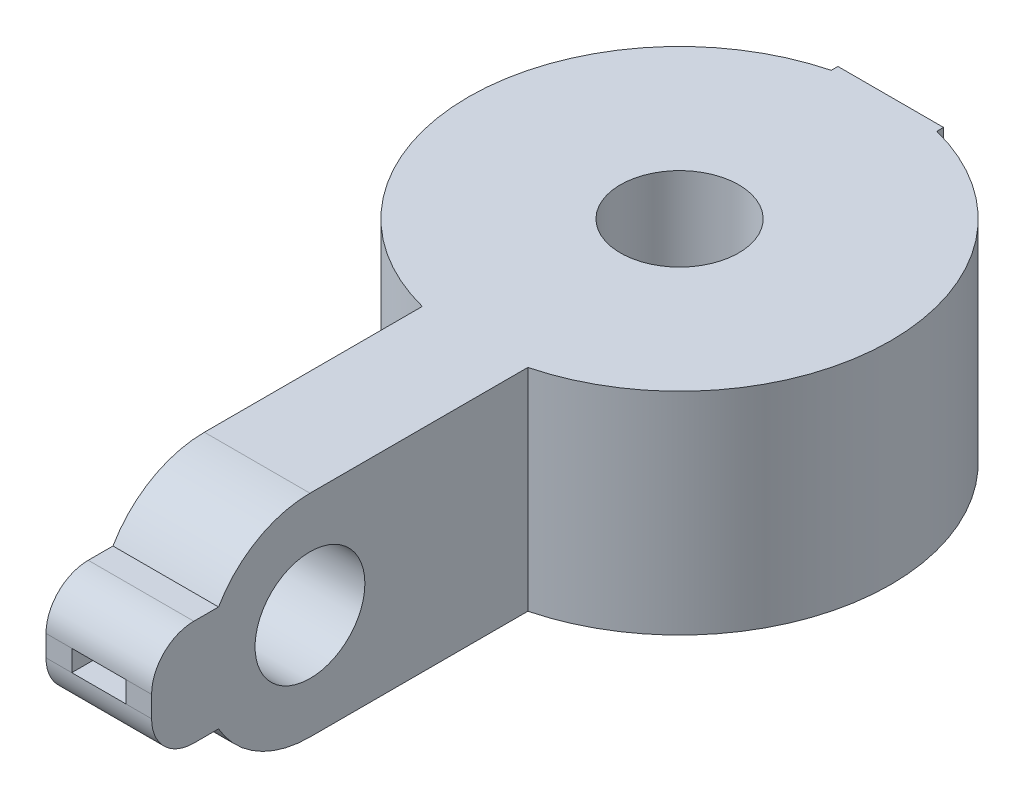
ISO-10303-21;
HEADER;
FILE_DESCRIPTION(('STEP AP214'),'2;1');
FILE_NAME('part.step','',(''),(''),'','','');
FILE_SCHEMA(('AUTOMOTIVE_DESIGN { 1 0 10303 214 1 1 1 1 }'));
ENDSEC;
DATA;
#1=APPLICATION_CONTEXT('core data for automotive mechanical design processes');
#2=APPLICATION_PROTOCOL_DEFINITION('international standard','automotive_design',2000,#1);
#3=PRODUCT_CONTEXT('',#1,'mechanical');
#4=PRODUCT('Part','Part','',(#3));
#5=PRODUCT_RELATED_PRODUCT_CATEGORY('part','',(#4));
#6=PRODUCT_DEFINITION_FORMATION('','',#4);
#7=PRODUCT_DEFINITION_CONTEXT('part definition',#1,'design');
#8=PRODUCT_DEFINITION('design','',#6,#7);
#9=PRODUCT_DEFINITION_SHAPE('','',#8);
#10=(LENGTH_UNIT() NAMED_UNIT(*) SI_UNIT(.MILLI.,.METRE.));
#11=(NAMED_UNIT(*) PLANE_ANGLE_UNIT() SI_UNIT($,.RADIAN.));
#12=(NAMED_UNIT(*) SI_UNIT($,.STERADIAN.) SOLID_ANGLE_UNIT());
#13=UNCERTAINTY_MEASURE_WITH_UNIT(LENGTH_MEASURE(1.E-05),#10,'distance_accuracy_value','');
#14=(GEOMETRIC_REPRESENTATION_CONTEXT(3) GLOBAL_UNCERTAINTY_ASSIGNED_CONTEXT((#13)) GLOBAL_UNIT_ASSIGNED_CONTEXT((#10,
#11,#12)) REPRESENTATION_CONTEXT('',''));
#15=CARTESIAN_POINT('',(0.,0.,0.));
#16=DIRECTION('',(0.,0.,1.));
#17=DIRECTION('',(1.,0.,0.));
#18=AXIS2_PLACEMENT_3D('',#15,#16,#17);
#19=CARTESIAN_POINT('',(3.175,-3.175,9.525));
#20=DIRECTION('',(0.,0.,-1.));
#21=DIRECTION('',(-1.,0.,0.));
#22=AXIS2_PLACEMENT_3D('',#19,#20,#21);
#23=PLANE('',#22);
#24=DIRECTION('',(0.,-1.,0.));
#25=VECTOR('',#24,1.);
#26=CARTESIAN_POINT('',(-3.175,-3.175,9.525));
#27=LINE('',#26,#25);
#28=CARTESIAN_POINT('',(-3.175,0.635,9.525));
#29=VERTEX_POINT('',#28);
#30=CARTESIAN_POINT('',(-3.175,-0.634999999999999,9.525));
#31=VERTEX_POINT('',#30);
#32=EDGE_CURVE('E344',#29,#31,#27,.T.);
#33=ORIENTED_EDGE('',*,*,#32,.T.);
#34=DIRECTION('',(-1.,0.,0.));
#35=VECTOR('',#34,1.);
#36=CARTESIAN_POINT('',(3.175,-0.634999999999999,9.525));
#37=LINE('',#36,#35);
#38=CARTESIAN_POINT('',(-1.6256,-0.635,9.525));
#39=VERTEX_POINT('',#38);
#40=EDGE_CURVE('E381',#31,#39,#37,.F.);
#41=ORIENTED_EDGE('',*,*,#40,.T.);
#42=DIRECTION('',(0.,-1.,0.));
#43=VECTOR('',#42,1.);
#44=CARTESIAN_POINT('',(-1.6256,0.635,9.525));
#45=LINE('',#44,#43);
#46=CARTESIAN_POINT('',(-1.6256,0.635,9.525));
#47=VERTEX_POINT('',#46);
#48=EDGE_CURVE('E221',#47,#39,#45,.T.);
#49=ORIENTED_EDGE('',*,*,#48,.F.);
#50=DIRECTION('',(-1.,0.,0.));
#51=VECTOR('',#50,1.);
#52=CARTESIAN_POINT('',(3.175,0.635,9.525));
#53=LINE('',#52,#51);
#54=EDGE_CURVE('E375',#47,#29,#53,.T.);
#55=ORIENTED_EDGE('',*,*,#54,.T.);
#56=EDGE_LOOP('',(#33,#41,#49,#55));
#57=FACE_BOUND('',#56,.T.);
#58=ADVANCED_FACE('F38',(#57),#23,.F.);
#59=CARTESIAN_POINT('',(0.,6.351,-25.4));
#60=DIRECTION('',(0.,-1.,0.));
#61=DIRECTION('',(0.,0.,-1.));
#62=AXIS2_PLACEMENT_3D('',#59,#60,#61);
#63=CYLINDRICAL_SURFACE('',#62,3.556);
#64=CARTESIAN_POINT('',(0.,6.35,-25.4));
#65=DIRECTION('',(0.,-1.,0.));
#66=DIRECTION('',(0.,0.,-1.));
#67=AXIS2_PLACEMENT_3D('',#64,#65,#66);
#68=CIRCLE('',#67,3.556);
#69=CARTESIAN_POINT('',(0.,6.35,-28.956));
#70=VERTEX_POINT('',#69);
#71=EDGE_CURVE('E277',#70,#70,#68,.F.);
#72=ORIENTED_EDGE('',*,*,#71,.T.);
#73=EDGE_LOOP('',(#72));
#74=FACE_BOUND('',#73,.T.);
#75=CARTESIAN_POINT('',(0.,0.,-25.4));
#76=DIRECTION('',(0.,-1.,0.));
#77=DIRECTION('',(0.,0.,-1.));
#78=AXIS2_PLACEMENT_3D('',#75,#76,#77);
#79=CIRCLE('',#78,3.556);
#80=CARTESIAN_POINT('',(0.,0.,-28.956));
#81=VERTEX_POINT('',#80);
#82=EDGE_CURVE('E273',#81,#81,#79,.F.);
#83=ORIENTED_EDGE('',*,*,#82,.F.);
#84=EDGE_LOOP('',(#83));
#85=FACE_BOUND('',#84,.T.);
#86=ADVANCED_FACE('F463',(#74,#85),#63,.F.);
#87=CARTESIAN_POINT('',(3.175,0.,0.));
#88=DIRECTION('',(1.,0.,0.));
#89=DIRECTION('',(0.,0.,-1.));
#90=AXIS2_PLACEMENT_3D('',#87,#88,#89);
#91=PLANE('',#90);
#92=DIRECTION('',(0.,1.,0.));
#93=VECTOR('',#92,1.);
#94=CARTESIAN_POINT('',(3.175,-42.2710244842766,-37.6967221242085));
#95=LINE('',#94,#93);
#96=CARTESIAN_POINT('',(3.175,-6.35,-37.6967221242085));
#97=VERTEX_POINT('',#96);
#98=CARTESIAN_POINT('',(3.175,6.35,-37.6967221242085));
#99=VERTEX_POINT('',#98);
#100=EDGE_CURVE('E296',#97,#99,#95,.T.);
#101=ORIENTED_EDGE('',*,*,#100,.F.);
#102=DIRECTION('',(0.,0.,-1.));
#103=VECTOR('',#102,1.);
#104=CARTESIAN_POINT('',(3.175,-6.35,0.));
#105=LINE('',#104,#103);
#106=CARTESIAN_POINT('',(3.175,-6.35,-38.1));
#107=VERTEX_POINT('',#106);
#108=EDGE_CURVE('E309',#97,#107,#105,.T.);
#109=ORIENTED_EDGE('',*,*,#108,.T.);
#110=DIRECTION('',(0.,1.,0.));
#111=VECTOR('',#110,1.);
#112=CARTESIAN_POINT('',(3.175,-6.35,-38.1));
#113=LINE('',#112,#111);
#114=CARTESIAN_POINT('',(3.175,6.35,-38.1));
#115=VERTEX_POINT('',#114);
#116=EDGE_CURVE('E313',#107,#115,#113,.T.);
#117=ORIENTED_EDGE('',*,*,#116,.T.);
#118=DIRECTION('',(0.,0.,1.));
#119=VECTOR('',#118,1.);
#120=CARTESIAN_POINT('',(3.175,6.35,0.));
#121=LINE('',#120,#119);
#122=EDGE_CURVE('E316',#115,#99,#121,.T.);
#123=ORIENTED_EDGE('',*,*,#122,.T.);
#124=EDGE_LOOP('',(#101,#109,#117,#123));
#125=FACE_BOUND('',#124,.T.);
#126=ADVANCED_FACE('F447',(#125),#91,.T.);
#127=CARTESIAN_POINT('',(-3.175,0.,0.));
#128=DIRECTION('',(1.,0.,0.));
#129=DIRECTION('',(0.,0.,-1.));
#130=AXIS2_PLACEMENT_3D('',#127,#128,#129);
#131=PLANE('',#130);
#132=DIRECTION('',(0.,0.,-1.));
#133=VECTOR('',#132,1.);
#134=CARTESIAN_POINT('',(-3.175,-6.35,0.));
#135=LINE('',#134,#133);
#136=CARTESIAN_POINT('',(-3.175,-6.35,-37.6967221242085));
#137=VERTEX_POINT('',#136);
#138=CARTESIAN_POINT('',(-3.175,-6.35,-38.1));
#139=VERTEX_POINT('',#138);
#140=EDGE_CURVE('E329',#137,#139,#135,.T.);
#141=ORIENTED_EDGE('',*,*,#140,.F.);
#142=DIRECTION('',(0.,1.,0.));
#143=VECTOR('',#142,1.);
#144=CARTESIAN_POINT('',(-3.175,-42.2710244842766,-37.6967221242085));
#145=LINE('',#144,#143);
#146=CARTESIAN_POINT('',(-3.175,6.35,-37.6967221242085));
#147=VERTEX_POINT('',#146);
#148=EDGE_CURVE('E290',#137,#147,#145,.T.);
#149=ORIENTED_EDGE('',*,*,#148,.T.);
#150=DIRECTION('',(0.,0.,1.));
#151=VECTOR('',#150,1.);
#152=CARTESIAN_POINT('',(-3.175,6.35,0.));
#153=LINE('',#152,#151);
#154=CARTESIAN_POINT('',(-3.175,6.35,-38.1));
#155=VERTEX_POINT('',#154);
#156=EDGE_CURVE('E337',#155,#147,#153,.T.);
#157=ORIENTED_EDGE('',*,*,#156,.F.);
#158=DIRECTION('',(0.,1.,0.));
#159=VECTOR('',#158,1.);
#160=CARTESIAN_POINT('',(-3.175,-6.35,-38.1));
#161=LINE('',#160,#159);
#162=EDGE_CURVE('E333',#139,#155,#161,.T.);
#163=ORIENTED_EDGE('',*,*,#162,.F.);
#164=EDGE_LOOP('',(#141,#149,#157,#163));
#165=FACE_BOUND('',#164,.T.);
#166=ADVANCED_FACE('F430',(#165),#131,.F.);
#167=DIRECTION('',(0.,-1.,0.));
#168=VECTOR('',#167,1.);
#169=CARTESIAN_POINT('',(3.175,-3.175,9.525));
#170=LINE('',#169,#168);
#171=CARTESIAN_POINT('',(3.175,0.635,9.525));
#172=VERTEX_POINT('',#171);
#173=CARTESIAN_POINT('',(3.175,-0.634999999999999,9.525));
#174=VERTEX_POINT('',#173);
#175=EDGE_CURVE('E322',#172,#174,#170,.T.);
#176=ORIENTED_EDGE('',*,*,#175,.T.);
#177=CARTESIAN_POINT('',(3.175,-0.634999999999999,6.985));
#178=DIRECTION('',(1.,0.,0.));
#179=DIRECTION('',(0.,0.,-1.));
#180=AXIS2_PLACEMENT_3D('',#177,#178,#179);
#181=CIRCLE('',#180,2.54);
#182=CARTESIAN_POINT('',(3.175,-3.175,6.985));
#183=VERTEX_POINT('',#182);
#184=EDGE_CURVE('E46',#174,#183,#181,.T.);
#185=ORIENTED_EDGE('',*,*,#184,.T.);
#186=DIRECTION('',(0.,0.,-1.));
#187=VECTOR('',#186,1.);
#188=CARTESIAN_POINT('',(3.175,-3.175,9.525));
#189=LINE('',#188,#187);
#190=CARTESIAN_POINT('',(3.175,-3.175,5.49926131403119));
#191=VERTEX_POINT('',#190);
#192=EDGE_CURVE('E324',#183,#191,#189,.T.);
#193=ORIENTED_EDGE('',*,*,#192,.T.);
#194=CARTESIAN_POINT('',(3.175,0.,0.));
#195=DIRECTION('',(1.,0.,0.));
#196=DIRECTION('',(0.,0.,-1.));
#197=AXIS2_PLACEMENT_3D('',#194,#195,#196);
#198=CIRCLE('',#197,6.35);
#199=CARTESIAN_POINT('',(3.175,-6.35,0.));
#200=VERTEX_POINT('',#199);
#201=EDGE_CURVE('E306',#191,#200,#198,.T.);
#202=ORIENTED_EDGE('',*,*,#201,.T.);
#203=CARTESIAN_POINT('',(3.175,-6.35,-13.1032778757915));
#204=VERTEX_POINT('',#203);
#205=EDGE_CURVE('E311',#200,#204,#105,.T.);
#206=ORIENTED_EDGE('',*,*,#205,.T.);
#207=DIRECTION('',(0.,1.,0.));
#208=VECTOR('',#207,1.);
#209=CARTESIAN_POINT('',(3.175,-42.2710244842766,-13.1032778757915));
#210=LINE('',#209,#208);
#211=CARTESIAN_POINT('',(3.175,6.35,-13.1032778757915));
#212=VERTEX_POINT('',#211);
#213=EDGE_CURVE('E293',#212,#204,#210,.F.);
#214=ORIENTED_EDGE('',*,*,#213,.F.);
#215=CARTESIAN_POINT('',(3.175,6.35,0.));
#216=VERTEX_POINT('',#215);
#217=EDGE_CURVE('E315',#212,#216,#121,.T.);
#218=ORIENTED_EDGE('',*,*,#217,.T.);
#219=CARTESIAN_POINT('',(3.175,0.,0.));
#220=DIRECTION('',(1.,0.,0.));
#221=DIRECTION('',(0.,0.,-1.));
#222=AXIS2_PLACEMENT_3D('',#219,#220,#221);
#223=CIRCLE('',#222,6.35);
#224=CARTESIAN_POINT('',(3.175,3.175,5.49926131403119));
#225=VERTEX_POINT('',#224);
#226=EDGE_CURVE('E318',#216,#225,#223,.T.);
#227=ORIENTED_EDGE('',*,*,#226,.T.);
#228=DIRECTION('',(0.,0.,1.));
#229=VECTOR('',#228,1.);
#230=CARTESIAN_POINT('',(3.175,3.175,9.525));
#231=LINE('',#230,#229);
#232=CARTESIAN_POINT('',(3.175,3.175,6.985));
#233=VERTEX_POINT('',#232);
#234=EDGE_CURVE('E320',#225,#233,#231,.T.);
#235=ORIENTED_EDGE('',*,*,#234,.T.);
#236=CARTESIAN_POINT('',(3.175,0.635,6.985));
#237=DIRECTION('',(1.,0.,0.));
#238=DIRECTION('',(0.,0.,-1.));
#239=AXIS2_PLACEMENT_3D('',#236,#237,#238);
#240=CIRCLE('',#239,2.54);
#241=EDGE_CURVE('E383',#233,#172,#240,.T.);
#242=ORIENTED_EDGE('',*,*,#241,.T.);
#243=EDGE_LOOP('',(#176,#185,#193,#202,#206,#214,#218,#227,#235,#242));
#244=FACE_BOUND('',#243,.T.);
#245=CARTESIAN_POINT('',(3.175,0.,0.));
#246=DIRECTION('',(1.,0.,0.));
#247=DIRECTION('',(0.,0.,-1.));
#248=AXIS2_PLACEMENT_3D('',#245,#246,#247);
#249=CIRCLE('',#248,3.302);
#250=CARTESIAN_POINT('',(3.175,0.,-3.302));
#251=VERTEX_POINT('',#250);
#252=EDGE_CURVE('E300',#251,#251,#249,.T.);
#253=ORIENTED_EDGE('',*,*,#252,.F.);
#254=EDGE_LOOP('',(#253));
#255=FACE_BOUND('',#254,.T.);
#256=ADVANCED_FACE('F387',(#244,#255),#91,.T.);
#257=DIRECTION('',(0.,0.,-1.));
#258=VECTOR('',#257,1.);
#259=CARTESIAN_POINT('',(-3.175,-3.175,9.525));
#260=LINE('',#259,#258);
#261=CARTESIAN_POINT('',(-3.175,-3.175,6.985));
#262=VERTEX_POINT('',#261);
#263=CARTESIAN_POINT('',(-3.175,-3.175,5.49926131403119));
#264=VERTEX_POINT('',#263);
#265=EDGE_CURVE('E310',#262,#264,#260,.T.);
#266=ORIENTED_EDGE('',*,*,#265,.F.);
#267=CARTESIAN_POINT('',(-3.175,-0.634999999999999,6.985));
#268=DIRECTION('',(1.,0.,0.));
#269=DIRECTION('',(0.,0.,-1.));
#270=AXIS2_PLACEMENT_3D('',#267,#268,#269);
#271=CIRCLE('',#270,2.54);
#272=EDGE_CURVE('E373',#262,#31,#271,.F.);
#273=ORIENTED_EDGE('',*,*,#272,.T.);
#274=ORIENTED_EDGE('',*,*,#32,.F.);
#275=CARTESIAN_POINT('',(-3.175,0.635,6.985));
#276=DIRECTION('',(1.,0.,0.));
#277=DIRECTION('',(0.,0.,-1.));
#278=AXIS2_PLACEMENT_3D('',#275,#276,#277);
#279=CIRCLE('',#278,2.54);
#280=CARTESIAN_POINT('',(-3.175,3.175,6.985));
#281=VERTEX_POINT('',#280);
#282=EDGE_CURVE('E371',#29,#281,#279,.F.);
#283=ORIENTED_EDGE('',*,*,#282,.T.);
#284=DIRECTION('',(0.,0.,1.));
#285=VECTOR('',#284,1.);
#286=CARTESIAN_POINT('',(-3.175,3.175,9.525));
#287=LINE('',#286,#285);
#288=CARTESIAN_POINT('',(-3.175,3.175,5.49926131403119));
#289=VERTEX_POINT('',#288);
#290=EDGE_CURVE('E342',#289,#281,#287,.T.);
#291=ORIENTED_EDGE('',*,*,#290,.F.);
#292=CARTESIAN_POINT('',(-3.175,0.,0.));
#293=DIRECTION('',(1.,0.,0.));
#294=DIRECTION('',(0.,0.,-1.));
#295=AXIS2_PLACEMENT_3D('',#292,#293,#294);
#296=CIRCLE('',#295,6.35);
#297=CARTESIAN_POINT('',(-3.175,6.35,0.));
#298=VERTEX_POINT('',#297);
#299=EDGE_CURVE('E340',#298,#289,#296,.T.);
#300=ORIENTED_EDGE('',*,*,#299,.F.);
#301=CARTESIAN_POINT('',(-3.175,6.35,-13.1032778757915));
#302=VERTEX_POINT('',#301);
#303=EDGE_CURVE('E336',#302,#298,#153,.T.);
#304=ORIENTED_EDGE('',*,*,#303,.F.);
#305=DIRECTION('',(0.,1.,0.));
#306=VECTOR('',#305,1.);
#307=CARTESIAN_POINT('',(-3.175,-42.2710244842766,-13.1032778757915));
#308=LINE('',#307,#306);
#309=CARTESIAN_POINT('',(-3.175,-6.35,-13.1032778757915));
#310=VERTEX_POINT('',#309);
#311=EDGE_CURVE('E287',#302,#310,#308,.F.);
#312=ORIENTED_EDGE('',*,*,#311,.T.);
#313=CARTESIAN_POINT('',(-3.175,-6.35,0.));
#314=VERTEX_POINT('',#313);
#315=EDGE_CURVE('E330',#314,#310,#135,.T.);
#316=ORIENTED_EDGE('',*,*,#315,.F.);
#317=CARTESIAN_POINT('',(-3.175,0.,0.));
#318=DIRECTION('',(1.,0.,0.));
#319=DIRECTION('',(0.,0.,-1.));
#320=AXIS2_PLACEMENT_3D('',#317,#318,#319);
#321=CIRCLE('',#320,6.35);
#322=EDGE_CURVE('E303',#264,#314,#321,.T.);
#323=ORIENTED_EDGE('',*,*,#322,.F.);
#324=EDGE_LOOP('',(#266,#273,#274,#283,#291,#300,#304,#312,#316,#323));
#325=FACE_BOUND('',#324,.T.);
#326=CARTESIAN_POINT('',(-3.175,0.,0.));
#327=DIRECTION('',(1.,0.,0.));
#328=DIRECTION('',(0.,0.,-1.));
#329=AXIS2_PLACEMENT_3D('',#326,#327,#328);
#330=CIRCLE('',#329,3.302);
#331=CARTESIAN_POINT('',(-3.175,0.,-3.302));
#332=VERTEX_POINT('',#331);
#333=EDGE_CURVE('E299',#332,#332,#330,.T.);
#334=ORIENTED_EDGE('',*,*,#333,.T.);
#335=EDGE_LOOP('',(#334));
#336=FACE_BOUND('',#335,.T.);
#337=ADVANCED_FACE('F401',(#325,#336),#131,.F.);
#338=CARTESIAN_POINT('',(3.175,0.,0.));
#339=DIRECTION('',(-1.,0.,0.));
#340=DIRECTION('',(0.,0.,1.));
#341=AXIS2_PLACEMENT_3D('',#338,#339,#340);
#342=CYLINDRICAL_SURFACE('',#341,6.35);
#343=ORIENTED_EDGE('',*,*,#322,.T.);
#344=DIRECTION('',(-1.,0.,0.));
#345=VECTOR('',#344,1.);
#346=CARTESIAN_POINT('',(3.175,-6.35,0.));
#347=LINE('',#346,#345);
#348=EDGE_CURVE('E360',#200,#314,#347,.T.);
#349=ORIENTED_EDGE('',*,*,#348,.F.);
#350=ORIENTED_EDGE('',*,*,#201,.F.);
#351=DIRECTION('',(-1.,0.,0.));
#352=VECTOR('',#351,1.);
#353=CARTESIAN_POINT('',(3.175,-3.175,5.49926131403119));
#354=LINE('',#353,#352);
#355=EDGE_CURVE('E326',#191,#264,#354,.T.);
#356=ORIENTED_EDGE('',*,*,#355,.T.);
#357=EDGE_LOOP('',(#343,#349,#350,#356));
#358=FACE_BOUND('',#357,.T.);
#359=ADVANCED_FACE('F439',(#358),#342,.T.);
#360=CARTESIAN_POINT('',(3.175,-6.35,0.));
#361=DIRECTION('',(0.,1.,0.));
#362=DIRECTION('',(0.,0.,1.));
#363=AXIS2_PLACEMENT_3D('',#360,#361,#362);
#364=PLANE('',#363);
#365=CARTESIAN_POINT('',(0.,-6.35,-25.4));
#366=DIRECTION('',(0.,-1.,0.));
#367=DIRECTION('',(0.,0.,-1.));
#368=AXIS2_PLACEMENT_3D('',#365,#366,#367);
#369=CIRCLE('',#368,9.921875);
#370=CARTESIAN_POINT('',(0.,-6.35,-35.321875));
#371=VERTEX_POINT('',#370);
#372=EDGE_CURVE('E260',#371,#371,#369,.T.);
#373=ORIENTED_EDGE('',*,*,#372,.F.);
#374=EDGE_LOOP('',(#373));
#375=FACE_BOUND('',#374,.T.);
#376=ORIENTED_EDGE('',*,*,#315,.T.);
#377=CARTESIAN_POINT('',(0.,-6.35,-25.4));
#378=DIRECTION('',(0.,1.,0.));
#379=DIRECTION('',(0.,0.,1.));
#380=AXIS2_PLACEMENT_3D('',#377,#378,#379);
#381=CIRCLE('',#380,12.7);
#382=EDGE_CURVE('E285',#310,#137,#381,.F.);
#383=ORIENTED_EDGE('',*,*,#382,.T.);
#384=ORIENTED_EDGE('',*,*,#140,.T.);
#385=DIRECTION('',(-1.,0.,0.));
#386=VECTOR('',#385,1.);
#387=CARTESIAN_POINT('',(3.175,-6.35,-38.1));
#388=LINE('',#387,#386);
#389=EDGE_CURVE('E358',#107,#139,#388,.T.);
#390=ORIENTED_EDGE('',*,*,#389,.F.);
#391=ORIENTED_EDGE('',*,*,#108,.F.);
#392=EDGE_CURVE('E284',#97,#204,#381,.F.);
#393=ORIENTED_EDGE('',*,*,#392,.T.);
#394=ORIENTED_EDGE('',*,*,#205,.F.);
#395=ORIENTED_EDGE('',*,*,#348,.T.);
#396=EDGE_LOOP('',(#376,#383,#384,#390,#391,#393,#394,#395));
#397=FACE_BOUND('',#396,.T.);
#398=ADVANCED_FACE('F435',(#375,#397),#364,.F.);
#399=CARTESIAN_POINT('',(3.175,-6.35,-38.1));
#400=DIRECTION('',(0.,0.,1.));
#401=DIRECTION('',(1.,0.,0.));
#402=AXIS2_PLACEMENT_3D('',#399,#400,#401);
#403=PLANE('',#402);
#404=DIRECTION('',(1.,0.,0.));
#405=VECTOR('',#404,1.);
#406=CARTESIAN_POINT('',(0.635,3.175,-38.1));
#407=LINE('',#406,#405);
#408=CARTESIAN_POINT('',(-0.635,3.175,-38.1));
#409=VERTEX_POINT('',#408);
#410=CARTESIAN_POINT('',(0.635,3.175,-38.1));
#411=VERTEX_POINT('',#410);
#412=EDGE_CURVE('E245',#409,#411,#407,.T.);
#413=ORIENTED_EDGE('',*,*,#412,.F.);
#414=DIRECTION('',(0.,1.,0.));
#415=VECTOR('',#414,1.);
#416=CARTESIAN_POINT('',(-0.635,-0.0254000000000001,-38.1));
#417=LINE('',#416,#415);
#418=CARTESIAN_POINT('',(-0.635,-0.0254000000000001,-38.1));
#419=VERTEX_POINT('',#418);
#420=EDGE_CURVE('E247',#419,#409,#417,.T.);
#421=ORIENTED_EDGE('',*,*,#420,.F.);
#422=DIRECTION('',(-1.,0.,0.));
#423=VECTOR('',#422,1.);
#424=CARTESIAN_POINT('',(0.635,-0.0254000000000001,-38.1));
#425=LINE('',#424,#423);
#426=CARTESIAN_POINT('',(0.635,-0.0254000000000001,-38.1));
#427=VERTEX_POINT('',#426);
#428=EDGE_CURVE('E238',#427,#419,#425,.T.);
#429=ORIENTED_EDGE('',*,*,#428,.F.);
#430=DIRECTION('',(0.,-1.,0.));
#431=VECTOR('',#430,1.);
#432=CARTESIAN_POINT('',(0.635,-0.0254000000000001,-38.1));
#433=LINE('',#432,#431);
#434=EDGE_CURVE('E242',#411,#427,#433,.T.);
#435=ORIENTED_EDGE('',*,*,#434,.F.);
#436=EDGE_LOOP('',(#413,#421,#429,#435));
#437=FACE_BOUND('',#436,.T.);
#438=ORIENTED_EDGE('',*,*,#389,.T.);
#439=ORIENTED_EDGE('',*,*,#162,.T.);
#440=DIRECTION('',(-1.,0.,0.));
#441=VECTOR('',#440,1.);
#442=CARTESIAN_POINT('',(3.175,6.35,-38.1));
#443=LINE('',#442,#441);
#444=EDGE_CURVE('E356',#115,#155,#443,.T.);
#445=ORIENTED_EDGE('',*,*,#444,.F.);
#446=ORIENTED_EDGE('',*,*,#116,.F.);
#447=EDGE_LOOP('',(#438,#439,#445,#446));
#448=FACE_BOUND('',#447,.T.);
#449=ADVANCED_FACE('F485',(#437,#448),#403,.F.);
#450=CARTESIAN_POINT('',(3.175,6.35,0.));
#451=DIRECTION('',(0.,-1.,0.));
#452=DIRECTION('',(0.,0.,-1.));
#453=AXIS2_PLACEMENT_3D('',#450,#451,#452);
#454=PLANE('',#453);
#455=ORIENTED_EDGE('',*,*,#71,.F.);
#456=EDGE_LOOP('',(#455));
#457=FACE_BOUND('',#456,.T.);
#458=ORIENTED_EDGE('',*,*,#156,.T.);
#459=CARTESIAN_POINT('',(0.,6.35,-25.4));
#460=DIRECTION('',(0.,1.,0.));
#461=DIRECTION('',(0.,0.,1.));
#462=AXIS2_PLACEMENT_3D('',#459,#460,#461);
#463=CIRCLE('',#462,12.7);
#464=EDGE_CURVE('E280',#147,#302,#463,.T.);
#465=ORIENTED_EDGE('',*,*,#464,.T.);
#466=ORIENTED_EDGE('',*,*,#303,.T.);
#467=DIRECTION('',(-1.,0.,0.));
#468=VECTOR('',#467,1.);
#469=CARTESIAN_POINT('',(3.175,6.35,0.));
#470=LINE('',#469,#468);
#471=EDGE_CURVE('E353',#216,#298,#470,.T.);
#472=ORIENTED_EDGE('',*,*,#471,.F.);
#473=ORIENTED_EDGE('',*,*,#217,.F.);
#474=EDGE_CURVE('E281',#212,#99,#463,.T.);
#475=ORIENTED_EDGE('',*,*,#474,.T.);
#476=ORIENTED_EDGE('',*,*,#122,.F.);
#477=ORIENTED_EDGE('',*,*,#444,.T.);
#478=EDGE_LOOP('',(#458,#465,#466,#472,#473,#475,#476,#477));
#479=FACE_BOUND('',#478,.T.);
#480=ADVANCED_FACE('F422',(#457,#479),#454,.F.);
#481=CARTESIAN_POINT('',(3.175,0.,0.));
#482=DIRECTION('',(-1.,0.,0.));
#483=DIRECTION('',(0.,0.,1.));
#484=AXIS2_PLACEMENT_3D('',#481,#482,#483);
#485=CYLINDRICAL_SURFACE('',#484,6.35);
#486=ORIENTED_EDGE('',*,*,#299,.T.);
#487=DIRECTION('',(-1.,0.,0.));
#488=VECTOR('',#487,1.);
#489=CARTESIAN_POINT('',(3.175,3.175,5.49926131403119));
#490=LINE('',#489,#488);
#491=EDGE_CURVE('E350',#225,#289,#490,.T.);
#492=ORIENTED_EDGE('',*,*,#491,.F.);
#493=ORIENTED_EDGE('',*,*,#226,.F.);
#494=ORIENTED_EDGE('',*,*,#471,.T.);
#495=EDGE_LOOP('',(#486,#492,#493,#494));
#496=FACE_BOUND('',#495,.T.);
#497=ADVANCED_FACE('F417',(#496),#485,.T.);
#498=CARTESIAN_POINT('',(3.175,3.175,9.525));
#499=DIRECTION('',(0.,-1.,0.));
#500=DIRECTION('',(0.,0.,-1.));
#501=AXIS2_PLACEMENT_3D('',#498,#499,#500);
#502=PLANE('',#501);
#503=ORIENTED_EDGE('',*,*,#290,.T.);
#504=DIRECTION('',(-1.,0.,0.));
#505=VECTOR('',#504,1.);
#506=CARTESIAN_POINT('',(3.175,3.175,6.985));
#507=LINE('',#506,#505);
#508=EDGE_CURVE('E11',#281,#233,#507,.F.);
#509=ORIENTED_EDGE('',*,*,#508,.T.);
#510=ORIENTED_EDGE('',*,*,#234,.F.);
#511=ORIENTED_EDGE('',*,*,#491,.T.);
#512=EDGE_LOOP('',(#503,#509,#510,#511));
#513=FACE_BOUND('',#512,.T.);
#514=ADVANCED_FACE('F413',(#513),#502,.F.);
#515=DIRECTION('',(0.,1.,0.));
#516=VECTOR('',#515,1.);
#517=CARTESIAN_POINT('',(1.6256,0.635,9.525));
#518=LINE('',#517,#516);
#519=CARTESIAN_POINT('',(1.6256,-0.635,9.525));
#520=VERTEX_POINT('',#519);
#521=CARTESIAN_POINT('',(1.6256,0.635,9.525));
#522=VERTEX_POINT('',#521);
#523=EDGE_CURVE('E202',#520,#522,#518,.T.);
#524=ORIENTED_EDGE('',*,*,#523,.F.);
#525=DIRECTION('',(-1.,0.,0.));
#526=VECTOR('',#525,1.);
#527=CARTESIAN_POINT('',(3.175,-0.634999999999999,9.525));
#528=LINE('',#527,#526);
#529=EDGE_CURVE('E59',#520,#174,#528,.F.);
#530=ORIENTED_EDGE('',*,*,#529,.T.);
#531=ORIENTED_EDGE('',*,*,#175,.F.);
#532=DIRECTION('',(-1.,0.,0.));
#533=VECTOR('',#532,1.);
#534=CARTESIAN_POINT('',(3.175,0.635,9.525));
#535=LINE('',#534,#533);
#536=EDGE_CURVE('E377',#172,#522,#535,.T.);
#537=ORIENTED_EDGE('',*,*,#536,.T.);
#538=EDGE_LOOP('',(#524,#530,#531,#537));
#539=FACE_BOUND('',#538,.T.);
#540=ADVANCED_FACE('F449',(#539),#23,.F.);
#541=CARTESIAN_POINT('',(3.175,-3.175,9.525));
#542=DIRECTION('',(0.,1.,0.));
#543=DIRECTION('',(0.,0.,1.));
#544=AXIS2_PLACEMENT_3D('',#541,#542,#543);
#545=PLANE('',#544);
#546=ORIENTED_EDGE('',*,*,#192,.F.);
#547=DIRECTION('',(-1.,0.,0.));
#548=VECTOR('',#547,1.);
#549=CARTESIAN_POINT('',(3.175,-3.175,6.985));
#550=LINE('',#549,#548);
#551=EDGE_CURVE('E368',#183,#262,#550,.T.);
#552=ORIENTED_EDGE('',*,*,#551,.T.);
#553=ORIENTED_EDGE('',*,*,#265,.T.);
#554=ORIENTED_EDGE('',*,*,#355,.F.);
#555=EDGE_LOOP('',(#546,#552,#553,#554));
#556=FACE_BOUND('',#555,.T.);
#557=ADVANCED_FACE('F393',(#556),#545,.F.);
#558=CARTESIAN_POINT('',(3.175,0.,0.));
#559=DIRECTION('',(-1.,0.,0.));
#560=DIRECTION('',(0.,0.,1.));
#561=AXIS2_PLACEMENT_3D('',#558,#559,#560);
#562=CYLINDRICAL_SURFACE('',#561,3.302);
#563=ORIENTED_EDGE('',*,*,#252,.T.);
#564=EDGE_LOOP('',(#563));
#565=FACE_BOUND('',#564,.T.);
#566=ORIENTED_EDGE('',*,*,#333,.F.);
#567=EDGE_LOOP('',(#566));
#568=FACE_BOUND('',#567,.T.);
#569=ADVANCED_FACE('F477',(#565,#568),#562,.F.);
#570=CARTESIAN_POINT('',(0.,-42.2710244842766,-25.4));
#571=DIRECTION('',(0.,1.,0.));
#572=DIRECTION('',(0.,0.,1.));
#573=AXIS2_PLACEMENT_3D('',#570,#571,#572);
#574=CYLINDRICAL_SURFACE('',#573,12.7);
#575=ORIENTED_EDGE('',*,*,#148,.F.);
#576=ORIENTED_EDGE('',*,*,#382,.F.);
#577=ORIENTED_EDGE('',*,*,#311,.F.);
#578=ORIENTED_EDGE('',*,*,#464,.F.);
#579=EDGE_LOOP('',(#575,#576,#577,#578));
#580=FACE_BOUND('',#579,.T.);
#581=ADVANCED_FACE('F427',(#580),#574,.T.);
#582=ORIENTED_EDGE('',*,*,#392,.F.);
#583=ORIENTED_EDGE('',*,*,#100,.T.);
#584=ORIENTED_EDGE('',*,*,#474,.F.);
#585=ORIENTED_EDGE('',*,*,#213,.T.);
#586=EDGE_LOOP('',(#582,#583,#584,#585));
#587=FACE_BOUND('',#586,.T.);
#588=ADVANCED_FACE('F444',(#587),#574,.T.);
#589=CARTESIAN_POINT('',(0.,0.,-25.4));
#590=DIRECTION('',(0.,-1.,0.));
#591=DIRECTION('',(0.,0.,-1.));
#592=AXIS2_PLACEMENT_3D('',#589,#590,#591);
#593=PLANE('',#592);
#594=CARTESIAN_POINT('',(0.,0.,-25.4));
#595=DIRECTION('',(0.,-1.,0.));
#596=DIRECTION('',(0.,0.,-1.));
#597=AXIS2_PLACEMENT_3D('',#594,#595,#596);
#598=CIRCLE('',#597,9.921875);
#599=CARTESIAN_POINT('',(0.635,0.,-35.3015341495965));
#600=VERTEX_POINT('',#599);
#601=CARTESIAN_POINT('',(-0.635,0.,-35.3015341495965));
#602=VERTEX_POINT('',#601);
#603=EDGE_CURVE('E270',#600,#602,#598,.T.);
#604=ORIENTED_EDGE('',*,*,#603,.T.);
#605=EDGE_CURVE('E274',#602,#600,#598,.T.);
#606=ORIENTED_EDGE('',*,*,#605,.T.);
#607=EDGE_LOOP('',(#604,#606));
#608=FACE_BOUND('',#607,.T.);
#609=ORIENTED_EDGE('',*,*,#82,.T.);
#610=EDGE_LOOP('',(#609));
#611=FACE_BOUND('',#610,.T.);
#612=ADVANCED_FACE('F624',(#608,#611),#593,.T.);
#613=CARTESIAN_POINT('',(0.,0.,-25.4));
#614=DIRECTION('',(0.,-1.,0.));
#615=DIRECTION('',(0.,0.,-1.));
#616=AXIS2_PLACEMENT_3D('',#613,#614,#615);
#617=CYLINDRICAL_SURFACE('',#616,9.921875);
#618=CARTESIAN_POINT('',(0.,-0.0254000000000001,-25.4));
#619=DIRECTION('',(0.,-1.,0.));
#620=DIRECTION('',(0.,0.,-1.));
#621=AXIS2_PLACEMENT_3D('',#618,#619,#620);
#622=CIRCLE('',#621,9.921875);
#623=CARTESIAN_POINT('',(-0.635,-0.0254000000000001,-35.3015341495965));
#624=VERTEX_POINT('',#623);
#625=CARTESIAN_POINT('',(0.635,-0.0254000000000001,-35.3015341495965));
#626=VERTEX_POINT('',#625);
#627=EDGE_CURVE('E265',#624,#626,#622,.T.);
#628=ORIENTED_EDGE('',*,*,#627,.F.);
#629=DIRECTION('',(0.,-1.,0.));
#630=VECTOR('',#629,1.);
#631=CARTESIAN_POINT('',(-0.635,0.,-35.3015341495965));
#632=LINE('',#631,#630);
#633=EDGE_CURVE('E363',#624,#602,#632,.F.);
#634=ORIENTED_EDGE('',*,*,#633,.T.);
#635=ORIENTED_EDGE('',*,*,#603,.F.);
#636=DIRECTION('',(0.,-1.,0.));
#637=VECTOR('',#636,1.);
#638=CARTESIAN_POINT('',(0.635,0.,-35.3015341495965));
#639=LINE('',#638,#637);
#640=EDGE_CURVE('E261',#626,#600,#639,.F.);
#641=ORIENTED_EDGE('',*,*,#640,.F.);
#642=EDGE_LOOP('',(#628,#634,#635,#641));
#643=FACE_BOUND('',#642,.T.);
#644=ORIENTED_EDGE('',*,*,#372,.T.);
#645=EDGE_LOOP('',(#644));
#646=FACE_BOUND('',#645,.T.);
#647=ADVANCED_FACE('F616',(#643,#646),#617,.F.);
#648=CARTESIAN_POINT('',(-0.635,-0.0254000000000001,9.526));
#649=DIRECTION('',(-1.,0.,0.));
#650=DIRECTION('',(0.,0.,1.));
#651=AXIS2_PLACEMENT_3D('',#648,#649,#650);
#652=PLANE('',#651);
#653=DIRECTION('',(0.,-1.,0.));
#654=VECTOR('',#653,1.);
#655=CARTESIAN_POINT('',(-0.635,0.,-35.3015341495965));
#656=LINE('',#655,#654);
#657=CARTESIAN_POINT('',(-0.635,3.175,-35.3015341495965));
#658=VERTEX_POINT('',#657);
#659=EDGE_CURVE('E241',#658,#602,#656,.T.);
#660=ORIENTED_EDGE('',*,*,#659,.T.);
#661=ORIENTED_EDGE('',*,*,#633,.F.);
#662=DIRECTION('',(0.,0.,-1.));
#663=VECTOR('',#662,1.);
#664=CARTESIAN_POINT('',(-0.635,-0.0254000000000001,9.526));
#665=LINE('',#664,#663);
#666=EDGE_CURVE('E251',#624,#419,#665,.T.);
#667=ORIENTED_EDGE('',*,*,#666,.T.);
#668=ORIENTED_EDGE('',*,*,#420,.T.);
#669=DIRECTION('',(0.,0.,-1.));
#670=VECTOR('',#669,1.);
#671=CARTESIAN_POINT('',(-0.635,3.175,9.526));
#672=LINE('',#671,#670);
#673=EDGE_CURVE('E233',#658,#409,#672,.T.);
#674=ORIENTED_EDGE('',*,*,#673,.F.);
#675=EDGE_LOOP('',(#660,#661,#667,#668,#674));
#676=FACE_BOUND('',#675,.T.);
#677=ADVANCED_FACE('F608',(#676),#652,.F.);
#678=CARTESIAN_POINT('',(0.635,3.175,9.526));
#679=DIRECTION('',(0.,1.,0.));
#680=DIRECTION('',(0.,0.,1.));
#681=AXIS2_PLACEMENT_3D('',#678,#679,#680);
#682=PLANE('',#681);
#683=CARTESIAN_POINT('',(0.,3.175,-25.4));
#684=DIRECTION('',(0.,1.,0.));
#685=DIRECTION('',(0.,0.,1.));
#686=AXIS2_PLACEMENT_3D('',#683,#684,#685);
#687=CIRCLE('',#686,9.921875);
#688=CARTESIAN_POINT('',(0.635,3.175,-35.3015341495965));
#689=VERTEX_POINT('',#688);
#690=EDGE_CURVE('E258',#689,#658,#687,.T.);
#691=ORIENTED_EDGE('',*,*,#690,.T.);
#692=ORIENTED_EDGE('',*,*,#673,.T.);
#693=ORIENTED_EDGE('',*,*,#412,.T.);
#694=DIRECTION('',(0.,0.,-1.));
#695=VECTOR('',#694,1.);
#696=CARTESIAN_POINT('',(0.635,3.175,9.526));
#697=LINE('',#696,#695);
#698=EDGE_CURVE('E253',#689,#411,#697,.T.);
#699=ORIENTED_EDGE('',*,*,#698,.F.);
#700=EDGE_LOOP('',(#691,#692,#693,#699));
#701=FACE_BOUND('',#700,.T.);
#702=ADVANCED_FACE('F600',(#701),#682,.F.);
#703=CARTESIAN_POINT('',(0.635,-0.0254000000000001,9.526));
#704=DIRECTION('',(0.,-1.,0.));
#705=DIRECTION('',(0.,0.,-1.));
#706=AXIS2_PLACEMENT_3D('',#703,#704,#705);
#707=PLANE('',#706);
#708=ORIENTED_EDGE('',*,*,#627,.T.);
#709=DIRECTION('',(0.,0.,-1.));
#710=VECTOR('',#709,1.);
#711=CARTESIAN_POINT('',(0.635,-0.0254000000000001,9.526));
#712=LINE('',#711,#710);
#713=EDGE_CURVE('E250',#626,#427,#712,.T.);
#714=ORIENTED_EDGE('',*,*,#713,.T.);
#715=ORIENTED_EDGE('',*,*,#428,.T.);
#716=ORIENTED_EDGE('',*,*,#666,.F.);
#717=EDGE_LOOP('',(#708,#714,#715,#716));
#718=FACE_BOUND('',#717,.T.);
#719=ADVANCED_FACE('F592',(#718),#707,.F.);
#720=CARTESIAN_POINT('',(0.635,-0.0254000000000001,9.526));
#721=DIRECTION('',(1.,0.,0.));
#722=DIRECTION('',(0.,0.,-1.));
#723=AXIS2_PLACEMENT_3D('',#720,#721,#722);
#724=PLANE('',#723);
#725=ORIENTED_EDGE('',*,*,#640,.T.);
#726=EDGE_CURVE('E264',#600,#689,#639,.F.);
#727=ORIENTED_EDGE('',*,*,#726,.T.);
#728=ORIENTED_EDGE('',*,*,#698,.T.);
#729=ORIENTED_EDGE('',*,*,#434,.T.);
#730=ORIENTED_EDGE('',*,*,#713,.F.);
#731=EDGE_LOOP('',(#725,#727,#728,#729,#730));
#732=FACE_BOUND('',#731,.T.);
#733=ADVANCED_FACE('F585',(#732),#724,.F.);
#734=CARTESIAN_POINT('',(0.,0.,-25.4));
#735=DIRECTION('',(0.,-1.,0.));
#736=DIRECTION('',(0.,0.,-1.));
#737=AXIS2_PLACEMENT_3D('',#734,#735,#736);
#738=CYLINDRICAL_SURFACE('',#737,9.921875);
#739=ORIENTED_EDGE('',*,*,#659,.F.);
#740=ORIENTED_EDGE('',*,*,#690,.F.);
#741=ORIENTED_EDGE('',*,*,#726,.F.);
#742=ORIENTED_EDGE('',*,*,#605,.F.);
#743=EDGE_LOOP('',(#739,#740,#741,#742));
#744=FACE_BOUND('',#743,.T.);
#745=ADVANCED_FACE('F569',(#744),#738,.T.);
#746=CARTESIAN_POINT('',(1.6256,0.635,6.35));
#747=DIRECTION('',(1.,0.,0.));
#748=DIRECTION('',(0.,0.,-1.));
#749=AXIS2_PLACEMENT_3D('',#746,#747,#748);
#750=PLANE('',#749);
#751=ORIENTED_EDGE('',*,*,#523,.T.);
#752=DIRECTION('',(0.,0.,1.));
#753=VECTOR('',#752,1.);
#754=CARTESIAN_POINT('',(1.6256,0.635,6.35));
#755=LINE('',#754,#753);
#756=CARTESIAN_POINT('',(1.6256,0.635,6.35));
#757=VERTEX_POINT('',#756);
#758=EDGE_CURVE('E196',#757,#522,#755,.T.);
#759=ORIENTED_EDGE('',*,*,#758,.F.);
#760=DIRECTION('',(0.,1.,0.));
#761=VECTOR('',#760,1.);
#762=CARTESIAN_POINT('',(1.6256,0.635,6.35));
#763=LINE('',#762,#761);
#764=CARTESIAN_POINT('',(1.6256,-0.635,6.35));
#765=VERTEX_POINT('',#764);
#766=EDGE_CURVE('E200',#765,#757,#763,.T.);
#767=ORIENTED_EDGE('',*,*,#766,.F.);
#768=DIRECTION('',(0.,0.,1.));
#769=VECTOR('',#768,1.);
#770=CARTESIAN_POINT('',(1.6256,-0.635,6.35));
#771=LINE('',#770,#769);
#772=EDGE_CURVE('E231',#765,#520,#771,.T.);
#773=ORIENTED_EDGE('',*,*,#772,.T.);
#774=EDGE_LOOP('',(#751,#759,#767,#773));
#775=FACE_BOUND('',#774,.T.);
#776=ADVANCED_FACE('F198',(#775),#750,.F.);
#777=CARTESIAN_POINT('',(-1.6256,-0.635,6.35));
#778=DIRECTION('',(0.,-1.,0.));
#779=DIRECTION('',(0.,0.,-1.));
#780=AXIS2_PLACEMENT_3D('',#777,#778,#779);
#781=PLANE('',#780);
#782=DIRECTION('',(1.,0.,0.));
#783=VECTOR('',#782,1.);
#784=CARTESIAN_POINT('',(-1.6256,-0.635,9.525));
#785=LINE('',#784,#783);
#786=EDGE_CURVE('E218',#39,#520,#785,.T.);
#787=ORIENTED_EDGE('',*,*,#786,.T.);
#788=ORIENTED_EDGE('',*,*,#772,.F.);
#789=DIRECTION('',(1.,0.,0.));
#790=VECTOR('',#789,1.);
#791=CARTESIAN_POINT('',(-1.6256,-0.635,6.35));
#792=LINE('',#791,#790);
#793=CARTESIAN_POINT('',(-1.6256,-0.635,6.35));
#794=VERTEX_POINT('',#793);
#795=EDGE_CURVE('E206',#794,#765,#792,.T.);
#796=ORIENTED_EDGE('',*,*,#795,.F.);
#797=DIRECTION('',(0.,0.,1.));
#798=VECTOR('',#797,1.);
#799=CARTESIAN_POINT('',(-1.6256,-0.635,6.35));
#800=LINE('',#799,#798);
#801=EDGE_CURVE('E234',#794,#39,#800,.T.);
#802=ORIENTED_EDGE('',*,*,#801,.T.);
#803=EDGE_LOOP('',(#787,#788,#796,#802));
#804=FACE_BOUND('',#803,.T.);
#805=ADVANCED_FACE('F451',(#804),#781,.F.);
#806=CARTESIAN_POINT('',(-1.6256,0.635,6.35));
#807=DIRECTION('',(-1.,0.,0.));
#808=DIRECTION('',(0.,0.,1.));
#809=AXIS2_PLACEMENT_3D('',#806,#807,#808);
#810=PLANE('',#809);
#811=ORIENTED_EDGE('',*,*,#48,.T.);
#812=ORIENTED_EDGE('',*,*,#801,.F.);
#813=DIRECTION('',(0.,-1.,0.));
#814=VECTOR('',#813,1.);
#815=CARTESIAN_POINT('',(-1.6256,0.635,6.35));
#816=LINE('',#815,#814);
#817=CARTESIAN_POINT('',(-1.6256,0.635,6.35));
#818=VERTEX_POINT('',#817);
#819=EDGE_CURVE('E214',#818,#794,#816,.T.);
#820=ORIENTED_EDGE('',*,*,#819,.F.);
#821=DIRECTION('',(0.,0.,1.));
#822=VECTOR('',#821,1.);
#823=CARTESIAN_POINT('',(-1.6256,0.635,6.35));
#824=LINE('',#823,#822);
#825=EDGE_CURVE('E205',#818,#47,#824,.T.);
#826=ORIENTED_EDGE('',*,*,#825,.T.);
#827=EDGE_LOOP('',(#811,#812,#820,#826));
#828=FACE_BOUND('',#827,.T.);
#829=ADVANCED_FACE('F453',(#828),#810,.F.);
#830=CARTESIAN_POINT('',(-1.6256,0.635,6.35));
#831=DIRECTION('',(0.,1.,0.));
#832=DIRECTION('',(0.,0.,1.));
#833=AXIS2_PLACEMENT_3D('',#830,#831,#832);
#834=PLANE('',#833);
#835=DIRECTION('',(-1.,0.,0.));
#836=VECTOR('',#835,1.);
#837=CARTESIAN_POINT('',(-1.6256,0.635,9.525));
#838=LINE('',#837,#836);
#839=EDGE_CURVE('E227',#522,#47,#838,.T.);
#840=ORIENTED_EDGE('',*,*,#839,.T.);
#841=ORIENTED_EDGE('',*,*,#825,.F.);
#842=DIRECTION('',(-1.,0.,0.));
#843=VECTOR('',#842,1.);
#844=CARTESIAN_POINT('',(-1.6256,0.635,6.35));
#845=LINE('',#844,#843);
#846=EDGE_CURVE('E209',#757,#818,#845,.T.);
#847=ORIENTED_EDGE('',*,*,#846,.F.);
#848=ORIENTED_EDGE('',*,*,#758,.T.);
#849=EDGE_LOOP('',(#840,#841,#847,#848));
#850=FACE_BOUND('',#849,.T.);
#851=ADVANCED_FACE('F210',(#850),#834,.F.);
#852=CARTESIAN_POINT('',(0.,0.,6.35));
#853=DIRECTION('',(0.,0.,1.));
#854=DIRECTION('',(1.,0.,0.));
#855=AXIS2_PLACEMENT_3D('',#852,#853,#854);
#856=PLANE('',#855);
#857=ORIENTED_EDGE('',*,*,#766,.T.);
#858=ORIENTED_EDGE('',*,*,#846,.T.);
#859=ORIENTED_EDGE('',*,*,#819,.T.);
#860=ORIENTED_EDGE('',*,*,#795,.T.);
#861=EDGE_LOOP('',(#857,#858,#859,#860));
#862=FACE_BOUND('',#861,.T.);
#863=ADVANCED_FACE('F216',(#862),#856,.T.);
#864=CARTESIAN_POINT('',(3.175,-0.634999999999999,6.985));
#865=DIRECTION('',(-1.,0.,0.));
#866=DIRECTION('',(0.,0.,1.));
#867=AXIS2_PLACEMENT_3D('',#864,#865,#866);
#868=CYLINDRICAL_SURFACE('',#867,2.54);
#869=ORIENTED_EDGE('',*,*,#786,.F.);
#870=ORIENTED_EDGE('',*,*,#40,.F.);
#871=ORIENTED_EDGE('',*,*,#272,.F.);
#872=ORIENTED_EDGE('',*,*,#551,.F.);
#873=ORIENTED_EDGE('',*,*,#184,.F.);
#874=ORIENTED_EDGE('',*,*,#529,.F.);
#875=EDGE_LOOP('',(#869,#870,#871,#872,#873,#874));
#876=FACE_BOUND('',#875,.T.);
#877=ADVANCED_FACE('F397',(#876),#868,.T.);
#878=CARTESIAN_POINT('',(3.175,0.635,6.985));
#879=DIRECTION('',(-1.,0.,0.));
#880=DIRECTION('',(0.,0.,1.));
#881=AXIS2_PLACEMENT_3D('',#878,#879,#880);
#882=CYLINDRICAL_SURFACE('',#881,2.54);
#883=ORIENTED_EDGE('',*,*,#241,.F.);
#884=ORIENTED_EDGE('',*,*,#508,.F.);
#885=ORIENTED_EDGE('',*,*,#282,.F.);
#886=ORIENTED_EDGE('',*,*,#54,.F.);
#887=ORIENTED_EDGE('',*,*,#839,.F.);
#888=ORIENTED_EDGE('',*,*,#536,.F.);
#889=EDGE_LOOP('',(#883,#884,#885,#886,#887,#888));
#890=FACE_BOUND('',#889,.T.);
#891=ADVANCED_FACE('F40',(#890),#882,.T.);
#892=CLOSED_SHELL('',(#58,#86,#126,#166,#256,#337,#359,#398,#449,#480,#497,#514,#540,#557,#569,
#581,#588,#612,#647,#677,#702,#719,#733,#745,#776,#805,#829,#851,#863,#877,#891));
#893=MANIFOLD_SOLID_BREP('B2',#892);
#894=ADVANCED_BREP_SHAPE_REPRESENTATION('',(#18,#893),#14);
#895=SHAPE_DEFINITION_REPRESENTATION(#9,#894);
ENDSEC;
END-ISO-10303-21;
